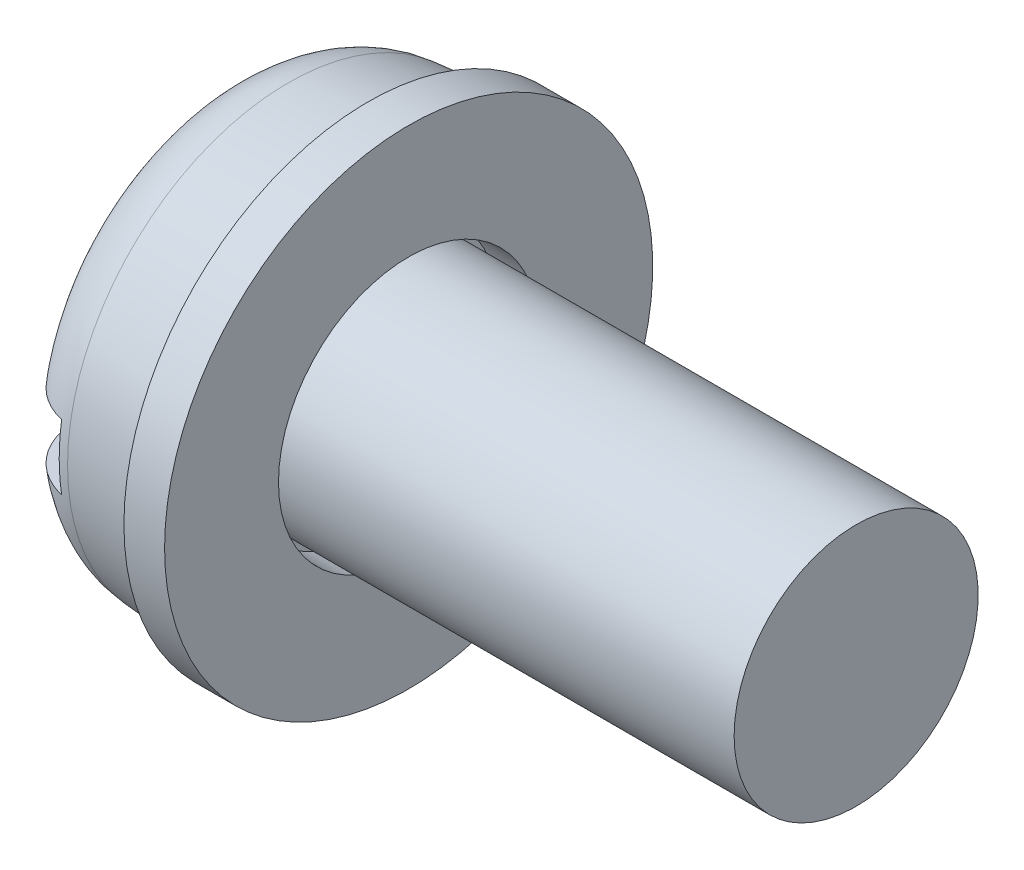
ISO-10303-21;
HEADER;
FILE_DESCRIPTION(('STEP AP214'),'2;1');
FILE_NAME('part.step','',(''),(''),'','','');
FILE_SCHEMA(('AUTOMOTIVE_DESIGN { 1 0 10303 214 1 1 1 1 }'));
ENDSEC;
DATA;
#1=APPLICATION_CONTEXT('core data for automotive mechanical design processes');
#2=APPLICATION_PROTOCOL_DEFINITION('international standard','automotive_design',2000,#1);
#3=PRODUCT_CONTEXT('',#1,'mechanical');
#4=PRODUCT('Part','Part','',(#3));
#5=PRODUCT_RELATED_PRODUCT_CATEGORY('part','',(#4));
#6=PRODUCT_DEFINITION_FORMATION('','',#4);
#7=PRODUCT_DEFINITION_CONTEXT('part definition',#1,'design');
#8=PRODUCT_DEFINITION('design','',#6,#7);
#9=PRODUCT_DEFINITION_SHAPE('','',#8);
#10=(LENGTH_UNIT() NAMED_UNIT(*) SI_UNIT(.MILLI.,.METRE.));
#11=(NAMED_UNIT(*) PLANE_ANGLE_UNIT() SI_UNIT($,.RADIAN.));
#12=(NAMED_UNIT(*) SI_UNIT($,.STERADIAN.) SOLID_ANGLE_UNIT());
#13=UNCERTAINTY_MEASURE_WITH_UNIT(LENGTH_MEASURE(1.E-05),#10,'distance_accuracy_value','');
#14=(GEOMETRIC_REPRESENTATION_CONTEXT(3) GLOBAL_UNCERTAINTY_ASSIGNED_CONTEXT((#13)) GLOBAL_UNIT_ASSIGNED_CONTEXT((#10,
#11,#12)) REPRESENTATION_CONTEXT('',''));
#15=CARTESIAN_POINT('',(0.,0.,0.));
#16=DIRECTION('',(0.,0.,1.));
#17=DIRECTION('',(1.,0.,0.));
#18=AXIS2_PLACEMENT_3D('',#15,#16,#17);
#19=CARTESIAN_POINT('',(-24.3859025800266,-1.10670574247449,0.));
#20=DIRECTION('',(-1.,0.,0.));
#21=DIRECTION('',(0.,0.,1.));
#22=AXIS2_PLACEMENT_3D('',#19,#20,#21);
#23=PLANE('',#22);
#24=DIRECTION('',(0.,0.,-1.));
#25=VECTOR('',#24,1.);
#26=CARTESIAN_POINT('',(-24.3859025800266,-0.706705742474488,2.8));
#27=LINE('',#26,#25);
#28=CARTESIAN_POINT('',(-24.3859025800266,-0.706705742474488,1.77326763142532));
#29=VERTEX_POINT('',#28);
#30=CARTESIAN_POINT('',(-24.3859025800266,-0.706705742474488,-1.77326763142532));
#31=VERTEX_POINT('',#30);
#32=EDGE_CURVE('P0_E71',#29,#31,#27,.T.);
#33=ORIENTED_EDGE('',*,*,#32,.F.);
#34=CARTESIAN_POINT('',(-24.3859025800266,-1.10670574247449,0.));
#35=DIRECTION('',(-1.,0.,0.));
#36=DIRECTION('',(0.,0.,1.));
#37=AXIS2_PLACEMENT_3D('',#34,#35,#36);
#38=CIRCLE('',#37,1.81782234903766);
#39=EDGE_CURVE('P0_E77',#29,#31,#38,.T.);
#40=ORIENTED_EDGE('',*,*,#39,.T.);
#41=EDGE_LOOP('',(#33,#40));
#42=FACE_BOUND('',#41,.T.);
#43=ADVANCED_FACE('P0_F17',(#42),#23,.T.);
#44=CARTESIAN_POINT('',(-49.7859025800265,-1.10670574247449,0.));
#45=DIRECTION('',(-1.,0.,0.));
#46=DIRECTION('',(0.,0.,1.));
#47=AXIS2_PLACEMENT_3D('',#44,#45,#46);
#48=CYLINDRICAL_SURFACE('',#47,1.5);
#49=CARTESIAN_POINT('',(-16.5859025800266,-1.10670574247449,0.));
#50=DIRECTION('',(-1.,0.,0.));
#51=DIRECTION('',(0.,0.,1.));
#52=AXIS2_PLACEMENT_3D('',#49,#50,#51);
#53=CIRCLE('',#52,1.5);
#54=CARTESIAN_POINT('',(-16.5859025800266,-1.10670574247449,1.5));
#55=VERTEX_POINT('',#54);
#56=EDGE_CURVE('P0_E78',#55,#55,#53,.T.);
#57=ORIENTED_EDGE('',*,*,#56,.T.);
#58=EDGE_LOOP('',(#57));
#59=FACE_BOUND('',#58,.T.);
#60=CARTESIAN_POINT('',(-22.5859025800266,-1.10670574247449,0.));
#61=DIRECTION('',(-1.,0.,0.));
#62=DIRECTION('',(0.,0.,1.));
#63=AXIS2_PLACEMENT_3D('',#60,#61,#62);
#64=CIRCLE('',#63,1.5);
#65=CARTESIAN_POINT('',(-22.5859025800266,-1.10670574247449,1.5));
#66=VERTEX_POINT('',#65);
#67=EDGE_CURVE('P0_E139',#66,#66,#64,.T.);
#68=ORIENTED_EDGE('',*,*,#67,.F.);
#69=EDGE_LOOP('',(#68));
#70=FACE_BOUND('',#69,.T.);
#71=ADVANCED_FACE('P0_F126',(#59,#70),#48,.T.);
#72=CARTESIAN_POINT('',(-16.5859025800266,0.393294257525512,0.));
#73=DIRECTION('',(1.,0.,0.));
#74=DIRECTION('',(0.,0.,-1.));
#75=AXIS2_PLACEMENT_3D('',#72,#73,#74);
#76=PLANE('',#75);
#77=ORIENTED_EDGE('',*,*,#56,.F.);
#78=EDGE_LOOP('',(#77));
#79=FACE_BOUND('',#78,.T.);
#80=ADVANCED_FACE('P0_F124',(#79),#76,.T.);
#81=DIRECTION('',(0.,0.,1.));
#82=VECTOR('',#81,1.);
#83=CARTESIAN_POINT('',(-24.3859025800266,-1.50670574247449,-2.8));
#84=LINE('',#83,#82);
#85=CARTESIAN_POINT('',(-24.3859025800266,-1.50670574247449,-1.77326763142532));
#86=VERTEX_POINT('',#85);
#87=CARTESIAN_POINT('',(-24.3859025800266,-1.50670574247449,1.77326763142532));
#88=VERTEX_POINT('',#87);
#89=EDGE_CURVE('P0_E62',#86,#88,#84,.T.);
#90=ORIENTED_EDGE('',*,*,#89,.F.);
#91=EDGE_CURVE('P0_E69',#86,#88,#38,.T.);
#92=ORIENTED_EDGE('',*,*,#91,.T.);
#93=EDGE_LOOP('',(#90,#92));
#94=FACE_BOUND('',#93,.T.);
#95=ADVANCED_FACE('P0_F68',(#94),#23,.T.);
#96=CARTESIAN_POINT('',(-24.3859025800266,-1.10670574247449,0.));
#97=DIRECTION('',(1.,0.,0.));
#98=DIRECTION('',(0.,0.,-1.));
#99=AXIS2_PLACEMENT_3D('',#96,#97,#98);
#100=CONICAL_SURFACE('',#99,2.64252040565334,0.0872664625997168);
#101=CARTESIAN_POINT('',(-23.5643427484994,-1.10670574247449,0.));
#102=DIRECTION('',(-1.,0.,0.));
#103=DIRECTION('',(0.,0.,1.));
#104=AXIS2_PLACEMENT_3D('',#101,#102,#103);
#105=CIRCLE('',#104,2.71439757732023);
#106=CARTESIAN_POINT('',(-23.5643427484994,-1.10670574247449,2.71439757732023));
#107=VERTEX_POINT('',#106);
#108=EDGE_CURVE('P0_E81',#107,#107,#105,.F.);
#109=ORIENTED_EDGE('',*,*,#108,.T.);
#110=EDGE_LOOP('',(#109));
#111=FACE_BOUND('',#110,.T.);
#112=CARTESIAN_POINT('',(-22.5859025800266,-1.10670574247449,0.));
#113=DIRECTION('',(-1.,0.,0.));
#114=DIRECTION('',(0.,0.,1.));
#115=AXIS2_PLACEMENT_3D('',#112,#113,#114);
#116=CIRCLE('',#115,2.8);
#117=CARTESIAN_POINT('',(-22.5859025800266,-1.10670574247449,2.8));
#118=VERTEX_POINT('',#117);
#119=EDGE_CURVE('P0_E83',#118,#118,#116,.T.);
#120=ORIENTED_EDGE('',*,*,#119,.T.);
#121=EDGE_LOOP('',(#120));
#122=FACE_BOUND('',#121,.T.);
#123=ADVANCED_FACE('P0_F117',(#111,#122),#100,.T.);
#124=CARTESIAN_POINT('',(-22.5859025800266,0.393294257525512,0.));
#125=DIRECTION('',(-1.,0.,0.));
#126=DIRECTION('',(0.,0.,1.));
#127=AXIS2_PLACEMENT_3D('',#124,#125,#126);
#128=PLANE('',#127);
#129=ORIENTED_EDGE('',*,*,#119,.F.);
#130=EDGE_LOOP('',(#129));
#131=FACE_BOUND('',#130,.T.);
#132=ORIENTED_EDGE('',*,*,#67,.T.);
#133=EDGE_LOOP('',(#132));
#134=FACE_BOUND('',#133,.T.);
#135=ADVANCED_FACE('P0_F113',(#131,#134),#128,.F.);
#136=CARTESIAN_POINT('',(-23.4859025800266,-1.10670574247449,0.));
#137=DIRECTION('',(-1.,0.,0.));
#138=DIRECTION('',(0.,0.,1.));
#139=AXIS2_PLACEMENT_3D('',#136,#137,#138);
#140=TOROIDAL_SURFACE('',#139,1.81782234903766,0.9);
#141=CARTESIAN_POINT('',(-23.9842064865148,-0.706705742474488,-2.53593152114129));
#142=CARTESIAN_POINT('',(-23.9426014622526,-0.706705742474488,-2.56393332788218));
#143=CARTESIAN_POINT('',(-23.8986133685519,-0.706705742474488,-2.58845843023252));
#144=CARTESIAN_POINT('',(-23.8071101544496,-0.706705742474488,-2.62980192456992));
#145=CARTESIAN_POINT('',(-23.7595910624852,-0.706705742474488,-2.64661148109401));
#146=CARTESIAN_POINT('',(-23.6624108856813,-0.706705742474488,-2.67199528317045));
#147=CARTESIAN_POINT('',(-23.6127504099764,-0.706705742474488,-2.6805718547261));
#148=CARTESIAN_POINT('',(-23.5127071094235,-0.706705742474488,-2.68923740018578));
#149=CARTESIAN_POINT('',(-23.4623244611167,-0.706705742474488,-2.68932841422142));
#150=CARTESIAN_POINT('',(-23.3623946062778,-0.706705742474488,-2.68103738118982));
#151=CARTESIAN_POINT('',(-23.3128455577481,-0.706705742474488,-2.67267751789981));
#152=CARTESIAN_POINT('',(-23.215850982308,-0.706705742474488,-2.64776531442094));
#153=CARTESIAN_POINT('',(-23.1684055184822,-0.706705742474488,-2.63121272872072));
#154=CARTESIAN_POINT('',(-23.0769079477492,-0.706705742474488,-2.59038229907007));
#155=CARTESIAN_POINT('',(-23.032859315082,-0.706705742474488,-2.5660966726896));
#156=CARTESIAN_POINT('',(-22.9494328616386,-0.706705742474488,-2.51051742624853));
#157=CARTESIAN_POINT('',(-22.9100551183194,-0.706705742474488,-2.47922368999777));
#158=CARTESIAN_POINT('',(-22.8368178511136,-0.706705742474488,-2.41032419236435));
#159=CARTESIAN_POINT('',(-22.8029936350758,-0.706705742474488,-2.37268091273685));
#160=CARTESIAN_POINT('',(-22.7420597246596,-0.706705742474488,-2.29230689336045));
#161=CARTESIAN_POINT('',(-22.7149503087624,-0.706705742474488,-2.24957594272072));
#162=CARTESIAN_POINT('',(-22.6678582694392,-0.706705742474488,-2.15971237578418));
#163=CARTESIAN_POINT('',(-22.647963092262,-0.706705742474488,-2.11253395536871));
#164=CARTESIAN_POINT('',(-22.6162216723193,-0.706705742474488,-2.01554593245494));
#165=CARTESIAN_POINT('',(-22.6043760248094,-0.706705742474488,-1.96573613566218));
#166=CARTESIAN_POINT('',(-22.5888239479357,-0.706705742474488,-1.86394560462762));
#167=CARTESIAN_POINT('',(-22.5852678378513,-0.706705742474488,-1.81194193297292));
#168=CARTESIAN_POINT('',(-22.5867233974926,-0.706705742474488,-1.70805700113295));
#169=CARTESIAN_POINT('',(-22.5917360552888,-0.706705742474488,-1.65617575575555));
#170=CARTESIAN_POINT('',(-22.610308215792,-0.706705742474488,-1.55269446133053));
#171=CARTESIAN_POINT('',(-22.6240678386976,-0.706705742474488,-1.50113034177219));
#172=CARTESIAN_POINT('',(-22.6598453567092,-0.706705742474488,-1.40095096381718));
#173=CARTESIAN_POINT('',(-22.6818644387379,-0.706705742474488,-1.35233613041373));
#174=CARTESIAN_POINT('',(-22.7341317102084,-0.706705742474488,-1.25824022538735));
#175=CARTESIAN_POINT('',(-22.7645614465764,-0.706705742474488,-1.21285988807693));
#176=CARTESIAN_POINT('',(-22.8325914840701,-0.706705742474488,-1.12780932458797));
#177=CARTESIAN_POINT('',(-22.8701938201797,-0.706705742474488,-1.08814072454133));
#178=CARTESIAN_POINT('',(-22.9517148424494,-0.706705742474488,-1.01571120097083));
#179=CARTESIAN_POINT('',(-22.9956470095661,-0.706705742474488,-0.982965398150425));
#180=CARTESIAN_POINT('',(-23.0886508436211,-0.706705742474488,-0.925820211344955));
#181=CARTESIAN_POINT('',(-23.1377201160802,-0.706705742474488,-0.901416961201436));
#182=CARTESIAN_POINT('',(-23.2366829473923,-0.706705742474488,-0.863395366502829));
#183=CARTESIAN_POINT('',(-23.2863692588602,-0.706705742474488,-0.849240526280142));
#184=CARTESIAN_POINT('',(-23.3874952532867,-0.706705742474488,-0.830450847570661));
#185=CARTESIAN_POINT('',(-23.4389332899208,-0.706705742474488,-0.825807308120568));
#186=CARTESIAN_POINT('',(-23.5369738590611,-0.706705742474488,-0.826338661096804));
#187=CARTESIAN_POINT('',(-23.5835833461514,-0.706705742474488,-0.830644672645143));
#188=CARTESIAN_POINT('',(-23.6753990292785,-0.706705742474488,-0.847082675101284));
#189=CARTESIAN_POINT('',(-23.7206049935353,-0.706705742474488,-0.859215951485934));
#190=CARTESIAN_POINT('',(-23.808176658339,-0.706705742474488,-0.890561229701253));
#191=CARTESIAN_POINT('',(-23.8505571286688,-0.706705742474488,-0.909732336345551));
#192=CARTESIAN_POINT('',(-23.9318629948841,-0.706705742474488,-0.954356114786257));
#193=CARTESIAN_POINT('',(-23.9707873898569,-0.706705742474488,-0.979810598293163));
#194=CARTESIAN_POINT('',(-24.047644296374,-0.706705742474488,-1.03863563377017));
#195=CARTESIAN_POINT('',(-24.0851979956376,-0.706705742474488,-1.07250127234658));
#196=CARTESIAN_POINT('',(-24.1545621834353,-0.706705742474488,-1.14567873524743));
#197=CARTESIAN_POINT('',(-24.1863707426651,-0.706705742474488,-1.1849923812911));
#198=CARTESIAN_POINT('',(-24.2455590429639,-0.706705742474488,-1.27100479329441));
#199=CARTESIAN_POINT('',(-24.2724673407634,-0.706705742474488,-1.31802904125808));
#200=CARTESIAN_POINT('',(-24.3181327919066,-0.706705742474488,-1.41588613859262));
#201=CARTESIAN_POINT('',(-24.3368890319716,-0.706705742474488,-1.466719413943));
#202=CARTESIAN_POINT('',(-24.3658420714525,-0.706705742474488,-1.57150752749652));
#203=CARTESIAN_POINT('',(-24.3759214592433,-0.706705742474488,-1.62549494001755));
#204=CARTESIAN_POINT('',(-24.3866770395012,-0.706705742474488,-1.73439964710515));
#205=CARTESIAN_POINT('',(-24.3873543603395,-0.706705742474488,-1.78931682929512));
#206=CARTESIAN_POINT('',(-24.3792427919666,-0.706705742474488,-1.8973585349181));
#207=CARTESIAN_POINT('',(-24.3706406634476,-0.706705742474488,-1.95049703954292));
#208=CARTESIAN_POINT('',(-24.3443981437481,-0.706705742474488,-2.05451158025993));
#209=CARTESIAN_POINT('',(-24.3267566028412,-0.706705742474488,-2.10538732765632));
#210=CARTESIAN_POINT('',(-24.2834229621712,-0.706705742474488,-2.20207106255329));
#211=CARTESIAN_POINT('',(-24.2579405702964,-0.706705742474488,-2.24797321246302));
#212=CARTESIAN_POINT('',(-24.1994966274998,-0.706705742474488,-2.3346826673761));
#213=CARTESIAN_POINT('',(-24.166545460072,-0.706705742474488,-2.37549692488183));
#214=CARTESIAN_POINT('',(-24.108250780855,-0.706705742474488,-2.43611780517026));
#215=CARTESIAN_POINT('',(-24.0849413335223,-0.706705742474488,-2.45791602542563));
#216=CARTESIAN_POINT('',(-24.0361444710632,-0.706705742474488,-2.49892172941219));
#217=CARTESIAN_POINT('',(-24.0106570781746,-0.706705742474488,-2.51812923959063));
#218=CARTESIAN_POINT('',(-23.9842064865148,-0.706705742474488,-2.53593152114129));
#219=B_SPLINE_CURVE_WITH_KNOTS('',3,(#141,#142,#143,#144,#145,#146,#147,#148,#149,#150,#151,
#152,#153,#154,#155,#156,#157,#158,#159,#160,#161,#162,#163,#164,#165,#166,#167,#168,#169,#170,
#171,#172,#173,#174,#175,#176,#177,#178,#179,#180,#181,#182,#183,#184,#185,#186,#187,#188,#189,
#190,#191,#192,#193,#194,#195,#196,#197,#198,#199,#200,#201,#202,#203,#204,#205,#206,#207,#208,
#209,#210,#211,#212,#213,#214,#215,#216,#217,#218),.UNSPECIFIED.,.T.,.F.,(4,2,2,2,2,2,2,2,2,2,2,
2,2,2,2,2,2,2,2,2,2,2,2,2,2,2,2,2,2,2,2,2,2,2,2,2,2,2,4),(0.,0.150335933494513,0.30084359739424,
0.451308726970355,0.601737681026104,0.751772777865595,0.901812371080129,1.05200344195132,
1.20219700308282,1.35331128753966,1.50443183806961,1.65732734739063,1.81023416196794,
1.96589285940572,2.1215695071664,2.28094272743601,2.44033885916066,2.60348795607713,
2.76668341009569,2.93023171311278,3.09370412047096,3.24783730341248,3.40182942181944,
3.5415702699926,3.68133407374162,3.82029827564248,3.95930259253055,4.11036263383425,
4.26147330942958,4.42325618279748,4.58505717610391,4.74901464634026,4.9129524393615,
5.07365129317271,5.23437059141101,5.39111839087745,5.54764959339694,5.64322735248863,
5.73880413580184),.UNSPECIFIED.);
#220=CARTESIAN_POINT('',(-23.6859025800266,-0.706705742474488,-2.66547244738019));
#221=VERTEX_POINT('',#220);
#222=EDGE_CURVE('P0_E11',#31,#221,#219,.T.);
#223=ORIENTED_EDGE('',*,*,#222,.F.);
#224=ORIENTED_EDGE('',*,*,#39,.F.);
#225=CARTESIAN_POINT('',(-23.7547273595577,-0.706705742474488,0.871495981540627));
#226=CARTESIAN_POINT('',(-23.7109980366854,-0.706705742474488,0.856438796500032));
#227=CARTESIAN_POINT('',(-23.6660243168668,-0.706705742474488,0.844929838444239));
#228=CARTESIAN_POINT('',(-23.5747668579291,-0.706705742474488,0.829645582358335));
#229=CARTESIAN_POINT('',(-23.5284829265365,-0.706705742474488,0.82587142543657));
#230=CARTESIAN_POINT('',(-23.4359349223138,-0.706705742474488,0.826292946243278));
#231=CARTESIAN_POINT('',(-23.3896708610284,-0.706705742474488,0.830491246695724));
#232=CARTESIAN_POINT('',(-23.2985113727283,-0.706705742474488,0.846603737630663));
#233=CARTESIAN_POINT('',(-23.2536162494193,-0.706705742474488,0.858519627443414));
#234=CARTESIAN_POINT('',(-23.1662909288502,-0.706705742474488,0.889449471124121));
#235=CARTESIAN_POINT('',(-23.1238642826916,-0.706705742474488,0.908473372222465));
#236=CARTESIAN_POINT('',(-23.0424462389243,-0.706705742474488,0.952815473313926));
#237=CARTESIAN_POINT('',(-23.0034559076027,-0.706705742474488,0.978135617780085));
#238=CARTESIAN_POINT('',(-22.9264648178725,-0.706705742474488,1.03667706350997));
#239=CARTESIAN_POINT('',(-22.8888385928245,-0.706705742474488,1.07039108297028));
#240=CARTESIAN_POINT('',(-22.8193036270762,-0.706705742474488,1.14327535241885));
#241=CARTESIAN_POINT('',(-22.7873967619759,-0.706705742474488,1.18244738484377));
#242=CARTESIAN_POINT('',(-22.7279614859572,-0.706705742474488,1.26820361081833));
#243=CARTESIAN_POINT('',(-22.7009064188429,-0.706705742474488,1.31511693869777));
#244=CARTESIAN_POINT('',(-22.6549264269163,-0.706705742474488,1.41277630231542));
#245=CARTESIAN_POINT('',(-22.636002439229,-0.706705742474488,1.46352277904048));
#246=CARTESIAN_POINT('',(-22.6066862669906,-0.706705742474488,1.56819037296415));
#247=CARTESIAN_POINT('',(-22.5964156559818,-0.706705742474488,1.62214568122431));
#248=CARTESIAN_POINT('',(-22.5852726842471,-0.706705742474488,1.73102148257415));
#249=CARTESIAN_POINT('',(-22.5843995759818,-0.706705742474488,1.78594189854469));
#250=CARTESIAN_POINT('',(-22.592126878585,-0.706705742474488,1.89403950300678));
#251=CARTESIAN_POINT('',(-22.6005431037869,-0.706705742474488,1.94722981003804));
#252=CARTESIAN_POINT('',(-22.6264222285019,-0.706705742474488,2.05136420293336));
#253=CARTESIAN_POINT('',(-22.6438839192046,-0.706705742474488,2.10230858794919));
#254=CARTESIAN_POINT('',(-22.6868696357372,-0.706705742474488,2.1991365537311));
#255=CARTESIAN_POINT('',(-22.7121791967976,-0.706705742474488,2.24511537218269));
#256=CARTESIAN_POINT('',(-22.7703095524447,-0.706705742474488,2.33205182310155));
#257=CARTESIAN_POINT('',(-22.8031294775647,-0.706705742474488,2.37301003595672));
#258=CARTESIAN_POINT('',(-22.8746228318876,-0.706705742474488,2.44787841079591));
#259=CARTESIAN_POINT('',(-22.9131650571217,-0.706705742474488,2.48191390856888));
#260=CARTESIAN_POINT('',(-22.9954826193072,-0.706705742474488,2.54292499319193));
#261=CARTESIAN_POINT('',(-23.0392575395924,-0.706705742474488,2.5699011416151));
#262=CARTESIAN_POINT('',(-23.1301607555879,-0.706705742474488,2.61566191750627));
#263=CARTESIAN_POINT('',(-23.1772362561106,-0.706705742474488,2.63455146707593));
#264=CARTESIAN_POINT('',(-23.2739045518892,-0.706705742474488,2.66409285611721));
#265=CARTESIAN_POINT('',(-23.3234972278697,-0.706705742474488,2.67474508552361));
#266=CARTESIAN_POINT('',(-23.4234000533732,-0.706705742474488,2.68744471269732));
#267=CARTESIAN_POINT('',(-23.4737022337731,-0.706705742474488,2.68955487726819));
#268=CARTESIAN_POINT('',(-23.5739437680512,-0.706705742474488,2.68528081529453));
#269=CARTESIAN_POINT('',(-23.6238831293605,-0.706705742474488,2.67889676322146));
#270=CARTESIAN_POINT('',(-23.7218750480369,-0.706705742474488,2.65784627208927));
#271=CARTESIAN_POINT('',(-23.769931300651,-0.706705742474488,2.643197022474));
#272=CARTESIAN_POINT('',(-23.8629123693497,-0.706705742474488,2.60606123058607));
#273=CARTESIAN_POINT('',(-23.907837173354,-0.706705742474488,2.58357465808084));
#274=CARTESIAN_POINT('',(-23.9934304704898,-0.706705742474488,2.53134616302211));
#275=CARTESIAN_POINT('',(-24.0340860643228,-0.706705742474488,2.50158310815031));
#276=CARTESIAN_POINT('',(-24.1098730700294,-0.706705742474488,2.4357048513604));
#277=CARTESIAN_POINT('',(-24.1450043355965,-0.706705742474488,2.39958948126101));
#278=CARTESIAN_POINT('',(-24.2090672466761,-0.706705742474488,2.32172709740984));
#279=CARTESIAN_POINT('',(-24.237945743197,-0.706705742474488,2.27993636985612));
#280=CARTESIAN_POINT('',(-24.2883874479194,-0.706705742474488,2.19215427977415));
#281=CARTESIAN_POINT('',(-24.3099502541526,-0.706705742474488,2.14616268660111));
#282=CARTESIAN_POINT('',(-24.3454908273703,-0.706705742474488,2.05060031814039));
#283=CARTESIAN_POINT('',(-24.3593575959846,-0.706705742474488,2.00098828619734));
#284=CARTESIAN_POINT('',(-24.3787452031473,-0.706705742474488,1.90016214005584));
#285=CARTESIAN_POINT('',(-24.3842652748238,-0.706705742474488,1.84894787909014));
#286=CARTESIAN_POINT('',(-24.3869390485912,-0.706705742474488,1.74525626284435));
#287=CARTESIAN_POINT('',(-24.3839195949994,-0.706705742474488,1.692774471539));
#288=CARTESIAN_POINT('',(-24.3693353223404,-0.706705742474488,1.5890162459782));
#289=CARTESIAN_POINT('',(-24.3577698051829,-0.706705742474488,1.53773991054426));
#290=CARTESIAN_POINT('',(-24.3261097076421,-0.706705742474488,1.43649219995258));
#291=CARTESIAN_POINT('',(-24.3058106569055,-0.706705742474488,1.3865847552086));
#292=CARTESIAN_POINT('',(-24.2572739092451,-0.706705742474488,1.29076759544655));
#293=CARTESIAN_POINT('',(-24.2290325788208,-0.706705742474488,1.2448597228063));
#294=CARTESIAN_POINT('',(-24.1647532182875,-0.706705742474488,1.15746425330815));
#295=CARTESIAN_POINT('',(-24.1285728864881,-0.706705742474488,1.11608124200677));
#296=CARTESIAN_POINT('',(-24.0497035481634,-0.706705742474488,1.04011285475969));
#297=CARTESIAN_POINT('',(-24.0070218075371,-0.706705742474488,1.00551998779309));
#298=CARTESIAN_POINT('',(-23.9295568352003,-0.706705742474488,0.953377181098868));
#299=CARTESIAN_POINT('',(-23.8961210694408,-0.706705742474488,0.93380296398965));
#300=CARTESIAN_POINT('',(-23.8269890218174,-0.706705742474488,0.899158166013482));
#301=CARTESIAN_POINT('',(-23.7912932369412,-0.706705742474488,0.884086599134742));
#302=CARTESIAN_POINT('',(-23.7547273595577,-0.706705742474488,0.871495981540627));
#303=B_SPLINE_CURVE_WITH_KNOTS('',3,(#225,#226,#227,#228,#229,#230,#231,#232,#233,#234,#235,
#236,#237,#238,#239,#240,#241,#242,#243,#244,#245,#246,#247,#248,#249,#250,#251,#252,#253,#254,
#255,#256,#257,#258,#259,#260,#261,#262,#263,#264,#265,#266,#267,#268,#269,#270,#271,#272,#273,
#274,#275,#276,#277,#278,#279,#280,#281,#282,#283,#284,#285,#286,#287,#288,#289,#290,#291,#292,
#293,#294,#295,#296,#297,#298,#299,#300,#301,#302),.UNSPECIFIED.,.T.,.F.,(4,2,2,2,2,2,2,2,2,2,2,
2,2,2,2,2,2,2,2,2,2,2,2,2,2,2,2,2,2,2,2,2,2,2,2,2,2,2,4),(0.,0.138615612916101,
0.277251674198892,0.415933350916855,0.554645574236206,0.693552648422645,0.832502674767944,
0.98342148511833,1.13438969741741,1.29610427307938,1.45783748170807,1.62180673071881,
1.78576293643649,1.94652574714201,2.10726707950299,2.2639540446038,2.42062287939072,
2.57413636036031,2.72763762557716,2.87908198292273,3.03051917082038,3.18084156107108,
3.3311608637429,3.4811686879926,3.63117709090574,3.78162643331956,3.93207975956823,
4.08376569017546,4.23545995397545,4.38928870771081,4.54313159395465,4.70011617891189,
4.85711358867004,5.01800577434983,5.17897168640495,5.34310060642745,5.50704742574204,
5.62298136153754,5.73888989092701),.UNSPECIFIED.);
#304=CARTESIAN_POINT('',(-23.6859025800266,-0.706705742474488,2.66547244738019));
#305=VERTEX_POINT('',#304);
#306=EDGE_CURVE('P0_E96',#305,#29,#303,.T.);
#307=ORIENTED_EDGE('',*,*,#306,.F.);
#308=CARTESIAN_POINT('',(-23.6859025800266,-1.10670574247449,0.));
#309=DIRECTION('',(-1.,0.,0.));
#310=DIRECTION('',(0.,0.,1.));
#311=AXIS2_PLACEMENT_3D('',#308,#309,#310);
#312=CIRCLE('',#311,2.69531878777687);
#313=CARTESIAN_POINT('',(-23.6859025800266,-1.50670574247449,2.66547244738019));
#314=VERTEX_POINT('',#313);
#315=EDGE_CURVE('P0_E89',#305,#314,#312,.F.);
#316=ORIENTED_EDGE('',*,*,#315,.T.);
#317=CARTESIAN_POINT('',(-23.7547273595577,-1.50670574247449,0.871495981540627));
#318=CARTESIAN_POINT('',(-23.8034625239749,-1.50670574247449,0.888281741940889));
#319=CARTESIAN_POINT('',(-23.8507276169709,-1.50670574247449,0.909503716497947));
#320=CARTESIAN_POINT('',(-23.9409991125138,-1.50670574247449,0.959728629210836));
#321=CARTESIAN_POINT('',(-23.9839950106572,-1.50670574247449,0.988750138784299));
#322=CARTESIAN_POINT('',(-24.0645032481523,-1.50670574247449,1.05330679583531));
#323=CARTESIAN_POINT('',(-24.1020357559253,-1.50670574247449,1.08881683540862));
#324=CARTESIAN_POINT('',(-24.1709555448604,-1.50670574247449,1.16532583126717));
#325=CARTESIAN_POINT('',(-24.2023455537468,-1.50670574247449,1.20632233747312));
#326=CARTESIAN_POINT('',(-24.2597292733964,-1.50670574247449,1.29499806178717));
#327=CARTESIAN_POINT('',(-24.2853587678404,-1.50670574247449,1.34291357063032));
#328=CARTESIAN_POINT('',(-24.3283035357385,-1.50670574247449,1.44234685085245));
#329=CARTESIAN_POINT('',(-24.3456172634424,-1.50670574247449,1.4938652899135));
#330=CARTESIAN_POINT('',(-24.3714730332166,-1.50670574247449,1.59957722380881));
#331=CARTESIAN_POINT('',(-24.3799316698189,-1.50670574247449,1.65379120331088));
#332=CARTESIAN_POINT('',(-24.3874176312215,-1.50670574247449,1.76286943896087));
#333=CARTESIAN_POINT('',(-24.3864458406881,-1.50670574247449,1.81773363362998));
#334=CARTESIAN_POINT('',(-24.3750962682397,-1.50670574247449,1.92531903415647));
#335=CARTESIAN_POINT('',(-24.3649161545484,-1.50670574247449,1.97806105250491));
#336=CARTESIAN_POINT('',(-24.3356153029584,-1.50670574247449,2.08100191154855));
#337=CARTESIAN_POINT('',(-24.3164958051339,-1.50670574247449,2.13120110391517));
#338=CARTESIAN_POINT('',(-24.270388773202,-1.50670574247449,2.22629801812597));
#339=CARTESIAN_POINT('',(-24.2436096939132,-1.50670574247449,2.27129684027619));
#340=CARTESIAN_POINT('',(-24.1827349181299,-1.50670574247449,2.35603997582291));
#341=CARTESIAN_POINT('',(-24.1486400249661,-1.50670574247449,2.39578486536653));
#342=CARTESIAN_POINT('',(-24.0748304298747,-1.50670574247449,2.46808210682477));
#343=CARTESIAN_POINT('',(-24.0352381860715,-1.50670574247449,2.50075952492731));
#344=CARTESIAN_POINT('',(-23.9510701743005,-1.50670574247449,2.55890052234819));
#345=CARTESIAN_POINT('',(-23.9064947910099,-1.50670574247449,2.5843646579657));
#346=CARTESIAN_POINT('',(-23.8142435477473,-1.50670574247449,2.62702917155574));
#347=CARTESIAN_POINT('',(-23.7666145574705,-1.50670574247449,2.64433093880064));
#348=CARTESIAN_POINT('',(-23.6691168352039,-1.50670574247449,2.67063086398603));
#349=CARTESIAN_POINT('',(-23.619248202401,-1.50670574247449,2.67962938927216));
#350=CARTESIAN_POINT('',(-23.5190514932611,-1.50670574247449,2.68902063968356));
#351=CARTESIAN_POINT('',(-23.4687288697374,-1.50670574247449,2.68947163706794));
#352=CARTESIAN_POINT('',(-23.3687252777363,-1.50670574247449,2.68190382365889));
#353=CARTESIAN_POINT('',(-23.3190442976704,-1.50670574247449,2.67388516605054));
#354=CARTESIAN_POINT('',(-23.2218134463794,-1.50670574247449,2.64963561785688));
#355=CARTESIAN_POINT('',(-23.1742603310104,-1.50670574247449,2.63341772685543));
#356=CARTESIAN_POINT('',(-23.0825390067834,-1.50670574247449,2.5932548985632));
#357=CARTESIAN_POINT('',(-23.038370817504,-1.50670574247449,2.56930991658271));
#358=CARTESIAN_POINT('',(-22.9545013677169,-1.50670574247449,2.51429882511239));
#359=CARTESIAN_POINT('',(-22.9148159580031,-1.50670574247449,2.48320855787322));
#360=CARTESIAN_POINT('',(-22.8411732166599,-1.50670574247449,2.41485918396244));
#361=CARTESIAN_POINT('',(-22.8072160559433,-1.50670574247449,2.37759989329229));
#362=CARTESIAN_POINT('',(-22.7456621379745,-1.50670574247449,2.29763356977095));
#363=CARTESIAN_POINT('',(-22.7181235233138,-1.50670574247449,2.2548817982485));
#364=CARTESIAN_POINT('',(-22.6704972403586,-1.50670574247449,2.16541487025925));
#365=CARTESIAN_POINT('',(-22.6504099920604,-1.50670574247449,2.11869949056591));
#366=CARTESIAN_POINT('',(-22.6179231381257,-1.50670574247449,2.02190542768205));
#367=CARTESIAN_POINT('',(-22.6056407315796,-1.50670574247449,1.97178743470805));
#368=CARTESIAN_POINT('',(-22.5894781498486,-1.50670574247449,1.87021727726405));
#369=CARTESIAN_POINT('',(-22.5855987542566,-1.50670574247449,1.81876498945237));
#370=CARTESIAN_POINT('',(-22.5862503219224,-1.50670574247449,1.71483495243173));
#371=CARTESIAN_POINT('',(-22.5909595348267,-1.50670574247449,1.66235834857243));
#372=CARTESIAN_POINT('',(-22.6088982884809,-1.50670574247449,1.55888409709202));
#373=CARTESIAN_POINT('',(-22.6221289095489,-1.50670574247449,1.50788663784912));
#374=CARTESIAN_POINT('',(-22.6570995475035,-1.50670574247449,1.40746214507163));
#375=CARTESIAN_POINT('',(-22.6790442628244,-1.50670574247449,1.3581063678032));
#376=CARTESIAN_POINT('',(-22.7307663719172,-1.50670574247449,1.2636760290119));
#377=CARTESIAN_POINT('',(-22.7605454488717,-1.50670574247449,1.21860239032601));
#378=CARTESIAN_POINT('',(-22.8277267575331,-1.50670574247449,1.13325277423327));
#379=CARTESIAN_POINT('',(-22.8652525585392,-1.50670574247449,1.09307386688499));
#380=CARTESIAN_POINT('',(-22.9466515839842,-1.50670574247449,1.01972901550195));
#381=CARTESIAN_POINT('',(-22.9905252430698,-1.50670574247449,0.986563552070545));
#382=CARTESIAN_POINT('',(-23.0824723261927,-1.50670574247449,0.929222350042134));
#383=CARTESIAN_POINT('',(-23.1304310144263,-1.50670574247449,0.904863533629854));
#384=CARTESIAN_POINT('',(-23.2300274155237,-1.50670574247449,0.865408006374134));
#385=CARTESIAN_POINT('',(-23.2816625982134,-1.50670574247449,0.850304993129927));
#386=CARTESIAN_POINT('',(-23.3823852964835,-1.50670574247449,0.831235729727251));
#387=CARTESIAN_POINT('',(-23.4313144179105,-1.50670574247449,0.826429393731615));
#388=CARTESIAN_POINT('',(-23.5291820161406,-1.50670574247449,0.825757597618513));
#389=CARTESIAN_POINT('',(-23.5781203248094,-1.50670574247449,0.829876411240601));
#390=CARTESIAN_POINT('',(-23.648062824181,-1.50670574247449,0.842103164129608));
#391=CARTESIAN_POINT('',(-23.6697157107129,-1.50670574247449,0.846800488735406));
#392=CARTESIAN_POINT('',(-23.7125785845709,-1.50670574247449,0.857891117601622));
#393=CARTESIAN_POINT('',(-23.7337886543692,-1.50670574247449,0.86428410295996));
#394=CARTESIAN_POINT('',(-23.7547273595577,-1.50670574247449,0.871495981540627));
#395=B_SPLINE_CURVE_WITH_KNOTS('',3,(#317,#318,#319,#320,#321,#322,#323,#324,#325,#326,#327,
#328,#329,#330,#331,#332,#333,#334,#335,#336,#337,#338,#339,#340,#341,#342,#343,#344,#345,#346,
#347,#348,#349,#350,#351,#352,#353,#354,#355,#356,#357,#358,#359,#360,#361,#362,#363,#364,#365,
#366,#367,#368,#369,#370,#371,#372,#373,#374,#375,#376,#377,#378,#379,#380,#381,#382,#383,#384,
#385,#386,#387,#388,#389,#390,#391,#392,#393,#394),.UNSPECIFIED.,.T.,.F.,(4,2,2,2,2,2,2,2,2,2,2,
2,2,2,2,2,2,2,2,2,2,2,2,2,2,2,2,2,2,2,2,2,2,2,2,2,2,2,4),(0.,0.154545929505517,
0.309463158544147,0.463793151236129,0.618054453677578,0.780314715588443,0.942605127077752,
1.10641075199289,1.27020101048904,1.43055663497239,1.59089002147255,1.74721863073234,
1.90353008272413,2.0567955472543,2.2100491885017,2.3613455070347,2.51263513171131,
2.66289297461214,2.81314809994484,2.96316574487771,3.11318425745476,3.26371763526344,
3.41425550371989,3.56610818035137,3.71796941486144,3.87206025933959,4.02616539904814,
4.18350533199931,4.3408652159535,4.50216376271748,4.66349699219782,4.82763600715278,
4.99178626625811,5.15229563882414,5.31269559661531,5.45941323508265,5.6058725648985,
5.67228456882568,5.73868409152545),.UNSPECIFIED.);
#396=EDGE_CURVE('P0_E76',#88,#314,#395,.T.);
#397=ORIENTED_EDGE('',*,*,#396,.F.);
#398=ORIENTED_EDGE('',*,*,#91,.F.);
#399=CARTESIAN_POINT('',(-23.9842064865148,-1.50670574247449,-2.53593152114129));
#400=CARTESIAN_POINT('',(-24.0264030101648,-1.50670574247449,-2.50752594853869));
#401=CARTESIAN_POINT('',(-24.0662121213911,-1.50670574247449,-2.47549983982046));
#402=CARTESIAN_POINT('',(-24.1398959343699,-1.50670574247449,-2.40516587836491));
#403=CARTESIAN_POINT('',(-24.1737624472856,-1.50670574247449,-2.36684949616946));
#404=CARTESIAN_POINT('',(-24.2345663502354,-1.50670574247449,-2.28512812362888));
#405=CARTESIAN_POINT('',(-24.2615112491331,-1.50670574247449,-2.24172872264131));
#406=CARTESIAN_POINT('',(-24.3078149896501,-1.50670574247449,-2.15107708021563));
#407=CARTESIAN_POINT('',(-24.3271757998563,-1.50670574247449,-2.10382584244335));
#408=CARTESIAN_POINT('',(-24.3580450810685,-1.50670574247449,-2.00623443962711));
#409=CARTESIAN_POINT('',(-24.3694616785733,-1.50670574247449,-1.95586524023863));
#410=CARTESIAN_POINT('',(-24.3838667697089,-1.50670574247449,-1.85393618870856));
#411=CARTESIAN_POINT('',(-24.3868541034305,-1.50670574247449,-1.80237617368877));
#412=CARTESIAN_POINT('',(-24.3843971682043,-1.50670574247449,-1.69835894015113));
#413=CARTESIAN_POINT('',(-24.378771792587,-1.50670574247449,-1.64590602749594));
#414=CARTESIAN_POINT('',(-24.3590174093757,-1.50670574247449,-1.54262865024755));
#415=CARTESIAN_POINT('',(-24.3448873458412,-1.50670574247449,-1.49180438869281));
#416=CARTESIAN_POINT('',(-24.3081331814826,-1.50670574247449,-1.39187524119994));
#417=CARTESIAN_POINT('',(-24.2853051516063,-1.50670574247449,-1.34284532896703));
#418=CARTESIAN_POINT('',(-24.2318739145258,-1.50670574247449,-1.24921236961778));
#419=CARTESIAN_POINT('',(-24.2012690026559,-1.50670574247449,-1.20461029605316));
#420=CARTESIAN_POINT('',(-24.1325327449378,-1.50670574247449,-1.12040413132917));
#421=CARTESIAN_POINT('',(-24.0942869182253,-1.50670574247449,-1.08089328983157));
#422=CARTESIAN_POINT('',(-24.0115518211386,-1.50670574247449,-1.00902344925026));
#423=CARTESIAN_POINT('',(-23.9670620572933,-1.50670574247449,-0.976665015956932));
#424=CARTESIAN_POINT('',(-23.8741706755506,-1.50670574247449,-0.921153761550259));
#425=CARTESIAN_POINT('',(-23.8258965558662,-1.50670574247449,-0.89778868831684));
#426=CARTESIAN_POINT('',(-23.7258690214994,-1.50670574247449,-0.860397113393027));
#427=CARTESIAN_POINT('',(-23.6741192106172,-1.50670574247449,-0.846361098476873));
#428=CARTESIAN_POINT('',(-23.573513355086,-1.50670574247449,-0.829368295388297));
#429=CARTESIAN_POINT('',(-23.5248033212912,-1.50670574247449,-0.825545352440831));
#430=CARTESIAN_POINT('',(-23.4274966808752,-1.50670574247449,-0.826719597327248));
#431=CARTESIAN_POINT('',(-23.3789000470289,-1.50670574247449,-0.831714388722304));
#432=CARTESIAN_POINT('',(-23.2862265602414,-1.50670574247449,-0.84962330141339));
#433=CARTESIAN_POINT('',(-23.2420530745269,-1.50670574247449,-0.862046867571477));
#434=CARTESIAN_POINT('',(-23.1562404647689,-1.50670574247449,-0.893742217847709));
#435=CARTESIAN_POINT('',(-23.114602068478,-1.50670574247449,-0.913015957700824));
#436=CARTESIAN_POINT('',(-23.0325153465483,-1.50670574247449,-0.958876506944366));
#437=CARTESIAN_POINT('',(-22.992260992625,-1.50670574247449,-0.98580952636011));
#438=CARTESIAN_POINT('',(-22.9163558673427,-1.50670574247449,-1.04552244383327));
#439=CARTESIAN_POINT('',(-22.8807066230776,-1.50670574247449,-1.07830427286891));
#440=CARTESIAN_POINT('',(-22.8117544577178,-1.50670574247449,-1.15198864954587));
#441=CARTESIAN_POINT('',(-22.7789461958152,-1.50670574247449,-1.19335517911256));
#442=CARTESIAN_POINT('',(-22.7204172713496,-1.50670574247449,-1.28083525691765));
#443=CARTESIAN_POINT('',(-22.6946982941237,-1.50670574247449,-1.32694993036066));
#444=CARTESIAN_POINT('',(-22.6501755709113,-1.50670574247449,-1.42462801939109));
#445=CARTESIAN_POINT('',(-22.6316848768305,-1.50670574247449,-1.47633466387386));
#446=CARTESIAN_POINT('',(-22.6037271179851,-1.50670574247449,-1.58213636524115));
#447=CARTESIAN_POINT('',(-22.5942599520053,-1.50670574247449,-1.63623139532851));
#448=CARTESIAN_POINT('',(-22.5847842321306,-1.50670574247449,-1.74478524431538));
#449=CARTESIAN_POINT('',(-22.5846958658128,-1.50670574247449,-1.79923704907971));
#450=CARTESIAN_POINT('',(-22.5939069358054,-1.50670574247449,-1.90734333327446));
#451=CARTESIAN_POINT('',(-22.6032052219477,-1.50670574247449,-1.96099790957378));
#452=CARTESIAN_POINT('',(-22.6306745371167,-1.50670574247449,-2.06455754692508));
#453=CARTESIAN_POINT('',(-22.6486190950311,-1.50670574247449,-2.11452267850709));
#454=CARTESIAN_POINT('',(-22.6928368969534,-1.50670574247449,-2.21062233517153));
#455=CARTESIAN_POINT('',(-22.7191090830088,-1.50670574247449,-2.25675734589841));
#456=CARTESIAN_POINT('',(-22.7785686277803,-1.50670574247449,-2.34276585756036));
#457=CARTESIAN_POINT('',(-22.8115830194602,-1.50670574247449,-2.38275897803032));
#458=CARTESIAN_POINT('',(-22.8839592492912,-1.50670574247449,-2.45651788071981));
#459=CARTESIAN_POINT('',(-22.9233204902472,-1.50670574247449,-2.49028424819412));
#460=CARTESIAN_POINT('',(-23.0065670844317,-1.50670574247449,-2.55005790908044));
#461=CARTESIAN_POINT('',(-23.050367472584,-1.50670574247449,-2.57618357878773));
#462=CARTESIAN_POINT('',(-23.1417643815871,-1.50670574247449,-2.62062313067505));
#463=CARTESIAN_POINT('',(-23.1893605087081,-1.50670574247449,-2.63893782183569));
#464=CARTESIAN_POINT('',(-23.286478790413,-1.50670574247449,-2.66705979300267));
#465=CARTESIAN_POINT('',(-23.3359765642884,-1.50670574247449,-2.67695133394454));
#466=CARTESIAN_POINT('',(-23.4359455735579,-1.50670574247449,-2.68824503862299));
#467=CARTESIAN_POINT('',(-23.4864170340111,-1.50670574247449,-2.6896452154879));
#468=CARTESIAN_POINT('',(-23.5866695845098,-1.50670574247449,-2.68392343190627));
#469=CARTESIAN_POINT('',(-23.6364526056022,-1.50670574247449,-2.67683486710842));
#470=CARTESIAN_POINT('',(-23.7340760842848,-1.50670574247449,-2.65440372943721));
#471=CARTESIAN_POINT('',(-23.7819189650991,-1.50670574247449,-2.63907181676455));
#472=CARTESIAN_POINT('',(-23.855435967382,-1.50670574247449,-2.60850240808469));
#473=CARTESIAN_POINT('',(-23.8821851935516,-1.50670574247449,-2.59578274416443));
#474=CARTESIAN_POINT('',(-23.9342945194768,-1.50670574247449,-2.56776112348693));
#475=CARTESIAN_POINT('',(-23.9596546254152,-1.50670574247449,-2.55245917822458));
#476=CARTESIAN_POINT('',(-23.9842064865148,-1.50670574247449,-2.53593152114129));
#477=B_SPLINE_CURVE_WITH_KNOTS('',3,(#399,#400,#401,#402,#403,#404,#405,#406,#407,#408,#409,
#410,#411,#412,#413,#414,#415,#416,#417,#418,#419,#420,#421,#422,#423,#424,#425,#426,#427,#428,
#429,#430,#431,#432,#433,#434,#435,#436,#437,#438,#439,#440,#441,#442,#443,#444,#445,#446,#447,
#448,#449,#450,#451,#452,#453,#454,#455,#456,#457,#458,#459,#460,#461,#462,#463,#464,#465,#466,
#467,#468,#469,#470,#471,#472,#473,#474,#475,#476),.UNSPECIFIED.,.T.,.F.,(4,2,2,2,2,2,2,2,2,2,2,
2,2,2,2,2,2,2,2,2,2,2,2,2,2,2,2,2,2,2,2,2,2,2,2,2,2,2,4),(0.,0.152490218607285,
0.305188944540643,0.457721310022948,0.610214056704589,0.764442291671229,0.91869174818651,
1.07622956938612,1.23378695448846,1.39529155818187,1.55683159371206,1.72100303477019,
1.88518745794618,2.04521666057681,2.2050824234249,2.35088226979051,2.49664249751799,
2.63370136587138,2.77079939621414,2.91549848817681,3.06024544108867,3.21793237831143,
3.37565677021802,3.539607260158,3.70355591107663,3.86610926645174,4.02864270620865,
4.18713298434998,4.34560313574806,4.5004280819907,4.65523846875457,4.80750509346896,
4.95975594414436,5.11046523737449,5.26120979331063,5.41136324663486,5.5613229886773,
5.65004914448152,5.73877490533682),.UNSPECIFIED.);
#478=CARTESIAN_POINT('',(-23.6859025800266,-1.50670574247449,-2.66547244738019));
#479=VERTEX_POINT('',#478);
#480=EDGE_CURVE('P0_E30',#479,#86,#477,.T.);
#481=ORIENTED_EDGE('',*,*,#480,.F.);
#482=EDGE_CURVE('P0_E42',#479,#221,#312,.F.);
#483=ORIENTED_EDGE('',*,*,#482,.T.);
#484=EDGE_LOOP('',(#223,#224,#307,#316,#397,#398,#481,#483));
#485=FACE_BOUND('',#484,.T.);
#486=ORIENTED_EDGE('',*,*,#108,.F.);
#487=EDGE_LOOP('',(#486));
#488=FACE_BOUND('',#487,.T.);
#489=ADVANCED_FACE('P0_F19',(#485,#488),#140,.T.);
#490=CARTESIAN_POINT('',(-23.6859025800266,-0.706705742474488,2.8));
#491=DIRECTION('',(0.,1.,0.));
#492=DIRECTION('',(0.,0.,1.));
#493=AXIS2_PLACEMENT_3D('',#490,#491,#492);
#494=PLANE('',#493);
#495=ORIENTED_EDGE('',*,*,#222,.T.);
#496=DIRECTION('',(0.,0.,-1.));
#497=VECTOR('',#496,1.);
#498=CARTESIAN_POINT('',(-23.6859025800266,-0.706705742474488,2.8));
#499=LINE('',#498,#497);
#500=EDGE_CURVE('P0_E70',#305,#221,#499,.T.);
#501=ORIENTED_EDGE('',*,*,#500,.F.);
#502=ORIENTED_EDGE('',*,*,#306,.T.);
#503=ORIENTED_EDGE('',*,*,#32,.T.);
#504=EDGE_LOOP('',(#495,#501,#502,#503));
#505=FACE_BOUND('',#504,.T.);
#506=ADVANCED_FACE('P0_F104',(#505),#494,.F.);
#507=CARTESIAN_POINT('',(-23.6859025800266,-1.50670574247449,-2.8));
#508=DIRECTION('',(0.,-1.,0.));
#509=DIRECTION('',(0.,0.,-1.));
#510=AXIS2_PLACEMENT_3D('',#507,#508,#509);
#511=PLANE('',#510);
#512=ORIENTED_EDGE('',*,*,#480,.T.);
#513=ORIENTED_EDGE('',*,*,#89,.T.);
#514=ORIENTED_EDGE('',*,*,#396,.T.);
#515=DIRECTION('',(0.,0.,1.));
#516=VECTOR('',#515,1.);
#517=CARTESIAN_POINT('',(-23.6859025800266,-1.50670574247449,-2.8));
#518=LINE('',#517,#516);
#519=EDGE_CURVE('P0_E37',#479,#314,#518,.T.);
#520=ORIENTED_EDGE('',*,*,#519,.F.);
#521=EDGE_LOOP('',(#512,#513,#514,#520));
#522=FACE_BOUND('',#521,.T.);
#523=ADVANCED_FACE('P0_F61',(#522),#511,.F.);
#524=CARTESIAN_POINT('',(-23.6859025800266,-0.706705742474488,-2.8));
#525=DIRECTION('',(-1.,0.,0.));
#526=DIRECTION('',(0.,0.,1.));
#527=AXIS2_PLACEMENT_3D('',#524,#525,#526);
#528=PLANE('',#527);
#529=ORIENTED_EDGE('',*,*,#519,.T.);
#530=ORIENTED_EDGE('',*,*,#315,.F.);
#531=ORIENTED_EDGE('',*,*,#500,.T.);
#532=ORIENTED_EDGE('',*,*,#482,.F.);
#533=EDGE_LOOP('',(#529,#530,#531,#532));
#534=FACE_BOUND('',#533,.T.);
#535=ADVANCED_FACE('P0_F103',(#534),#528,.T.);
#536=CLOSED_SHELL('',(#43,#71,#80,#95,#123,#135,#489,#506,#523,#535));
#537=MANIFOLD_SOLID_BREP('P0_B1',#536);
#538=CARTESIAN_POINT('',(-57.0109025800265,-1.10670574247449,0.));
#539=DIRECTION('',(-1.,0.,0.));
#540=DIRECTION('',(0.,0.,1.));
#541=AXIS2_PLACEMENT_3D('',#538,#539,#540);
#542=CYLINDRICAL_SURFACE('',#541,1.6);
#543=CARTESIAN_POINT('',(-22.0859025800266,-1.10670574247449,0.));
#544=DIRECTION('',(-1.,0.,0.));
#545=DIRECTION('',(0.,0.,1.));
#546=AXIS2_PLACEMENT_3D('',#543,#544,#545);
#547=CIRCLE('',#546,1.6);
#548=CARTESIAN_POINT('',(-22.0859025800266,-1.10670574247449,1.6));
#549=VERTEX_POINT('',#548);
#550=EDGE_CURVE('P1_E9',#549,#549,#547,.T.);
#551=ORIENTED_EDGE('',*,*,#550,.F.);
#552=EDGE_LOOP('',(#551));
#553=FACE_BOUND('',#552,.T.);
#554=CARTESIAN_POINT('',(-22.5859025800266,-1.10670574247449,0.));
#555=DIRECTION('',(-1.,0.,0.));
#556=DIRECTION('',(0.,0.,1.));
#557=AXIS2_PLACEMENT_3D('',#554,#555,#556);
#558=CIRCLE('',#557,1.6);
#559=CARTESIAN_POINT('',(-22.5859025800266,-1.10670574247449,1.6));
#560=VERTEX_POINT('',#559);
#561=EDGE_CURVE('P1_E28',#560,#560,#558,.T.);
#562=ORIENTED_EDGE('',*,*,#561,.T.);
#563=EDGE_LOOP('',(#562));
#564=FACE_BOUND('',#563,.T.);
#565=ADVANCED_FACE('P1_F14',(#553,#564),#542,.F.);
#566=CARTESIAN_POINT('',(-22.0859025800266,0.493294257525512,0.));
#567=DIRECTION('',(-1.,0.,0.));
#568=DIRECTION('',(0.,0.,1.));
#569=AXIS2_PLACEMENT_3D('',#566,#567,#568);
#570=PLANE('',#569);
#571=CARTESIAN_POINT('',(-22.0859025800266,-1.10670574247449,0.));
#572=DIRECTION('',(-1.,0.,0.));
#573=DIRECTION('',(0.,0.,1.));
#574=AXIS2_PLACEMENT_3D('',#571,#572,#573);
#575=CIRCLE('',#574,3.);
#576=CARTESIAN_POINT('',(-22.0859025800266,-1.10670574247449,3.));
#577=VERTEX_POINT('',#576);
#578=EDGE_CURVE('P1_E20',#577,#577,#575,.T.);
#579=ORIENTED_EDGE('',*,*,#578,.F.);
#580=EDGE_LOOP('',(#579));
#581=FACE_BOUND('',#580,.T.);
#582=ORIENTED_EDGE('',*,*,#550,.T.);
#583=EDGE_LOOP('',(#582));
#584=FACE_BOUND('',#583,.T.);
#585=ADVANCED_FACE('P1_F43',(#581,#584),#570,.F.);
#586=CARTESIAN_POINT('',(-57.0109025800265,-1.10670574247449,0.));
#587=DIRECTION('',(-1.,0.,0.));
#588=DIRECTION('',(0.,0.,1.));
#589=AXIS2_PLACEMENT_3D('',#586,#587,#588);
#590=CYLINDRICAL_SURFACE('',#589,3.);
#591=CARTESIAN_POINT('',(-22.5859025800266,-1.10670574247449,0.));
#592=DIRECTION('',(-1.,0.,0.));
#593=DIRECTION('',(0.,0.,1.));
#594=AXIS2_PLACEMENT_3D('',#591,#592,#593);
#595=CIRCLE('',#594,3.);
#596=CARTESIAN_POINT('',(-22.5859025800266,-1.10670574247449,3.));
#597=VERTEX_POINT('',#596);
#598=EDGE_CURVE('P1_E24',#597,#597,#595,.T.);
#599=ORIENTED_EDGE('',*,*,#598,.F.);
#600=EDGE_LOOP('',(#599));
#601=FACE_BOUND('',#600,.T.);
#602=ORIENTED_EDGE('',*,*,#578,.T.);
#603=EDGE_LOOP('',(#602));
#604=FACE_BOUND('',#603,.T.);
#605=ADVANCED_FACE('P1_F38',(#601,#604),#590,.T.);
#606=CARTESIAN_POINT('',(-22.5859025800266,1.89329425752551,0.));
#607=DIRECTION('',(1.,0.,0.));
#608=DIRECTION('',(0.,0.,-1.));
#609=AXIS2_PLACEMENT_3D('',#606,#607,#608);
#610=PLANE('',#609);
#611=ORIENTED_EDGE('',*,*,#561,.F.);
#612=EDGE_LOOP('',(#611));
#613=FACE_BOUND('',#612,.T.);
#614=ORIENTED_EDGE('',*,*,#598,.T.);
#615=EDGE_LOOP('',(#614));
#616=FACE_BOUND('',#615,.T.);
#617=ADVANCED_FACE('P1_F35',(#613,#616),#610,.F.);
#618=CLOSED_SHELL('',(#565,#585,#605,#617));
#619=MANIFOLD_SOLID_BREP('P1_B1',#618);
#620=ADVANCED_BREP_SHAPE_REPRESENTATION('',(#18,#537,#619),#14);
#621=SHAPE_DEFINITION_REPRESENTATION(#9,#620);
ENDSEC;
END-ISO-10303-21;
